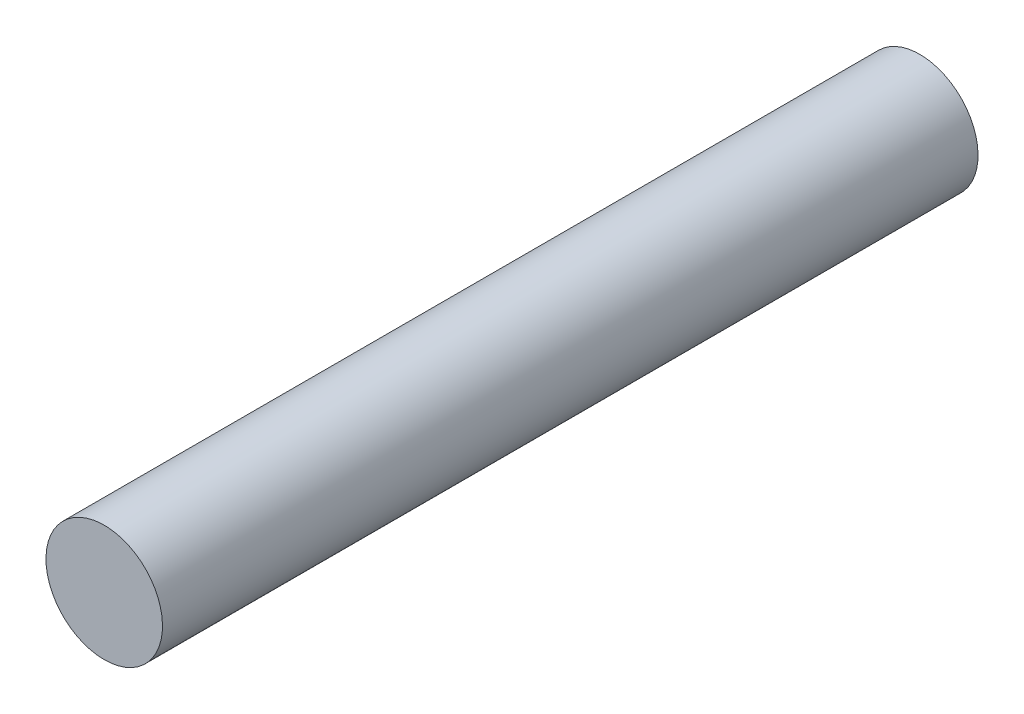
ISO-10303-21;
HEADER;
FILE_DESCRIPTION(('STEP AP214'),'2;1');
FILE_NAME('part.step','',(''),(''),'','','');
FILE_SCHEMA(('AUTOMOTIVE_DESIGN { 1 0 10303 214 1 1 1 1 }'));
ENDSEC;
DATA;
#1=APPLICATION_CONTEXT('core data for automotive mechanical design processes');
#2=APPLICATION_PROTOCOL_DEFINITION('international standard','automotive_design',2000,#1);
#3=PRODUCT_CONTEXT('',#1,'mechanical');
#4=PRODUCT('Part','Part','',(#3));
#5=PRODUCT_RELATED_PRODUCT_CATEGORY('part','',(#4));
#6=PRODUCT_DEFINITION_FORMATION('','',#4);
#7=PRODUCT_DEFINITION_CONTEXT('part definition',#1,'design');
#8=PRODUCT_DEFINITION('design','',#6,#7);
#9=PRODUCT_DEFINITION_SHAPE('','',#8);
#10=(LENGTH_UNIT() NAMED_UNIT(*) SI_UNIT(.MILLI.,.METRE.));
#11=(NAMED_UNIT(*) PLANE_ANGLE_UNIT() SI_UNIT($,.RADIAN.));
#12=(NAMED_UNIT(*) SI_UNIT($,.STERADIAN.) SOLID_ANGLE_UNIT());
#13=UNCERTAINTY_MEASURE_WITH_UNIT(LENGTH_MEASURE(1.E-05),#10,'distance_accuracy_value','');
#14=(GEOMETRIC_REPRESENTATION_CONTEXT(3) GLOBAL_UNCERTAINTY_ASSIGNED_CONTEXT((#13)) GLOBAL_UNIT_ASSIGNED_CONTEXT((#10,
#11,#12)) REPRESENTATION_CONTEXT('',''));
#15=CARTESIAN_POINT('',(0.,0.,0.));
#16=DIRECTION('',(0.,0.,1.));
#17=DIRECTION('',(1.,0.,0.));
#18=AXIS2_PLACEMENT_3D('',#15,#16,#17);
#19=CARTESIAN_POINT('',(0.,0.,70.));
#20=DIRECTION('',(0.,0.,-1.));
#21=DIRECTION('',(0.,1.,0.));
#22=AXIS2_PLACEMENT_3D('',#19,#20,#21);
#23=CYLINDRICAL_SURFACE('',#22,5.);
#24=CARTESIAN_POINT('',(0.,0.,70.));
#25=DIRECTION('',(0.,0.,1.));
#26=DIRECTION('',(0.,-1.,0.));
#27=AXIS2_PLACEMENT_3D('',#24,#25,#26);
#28=CIRCLE('',#27,5.);
#29=CARTESIAN_POINT('',(0.,-5.,70.));
#30=VERTEX_POINT('',#29);
#31=EDGE_CURVE('E10',#30,#30,#28,.T.);
#32=ORIENTED_EDGE('',*,*,#31,.F.);
#33=EDGE_LOOP('',(#32));
#34=FACE_BOUND('',#33,.T.);
#35=CARTESIAN_POINT('',(0.,0.,0.));
#36=DIRECTION('',(0.,0.,1.));
#37=DIRECTION('',(0.,-1.,0.));
#38=AXIS2_PLACEMENT_3D('',#35,#36,#37);
#39=CIRCLE('',#38,5.);
#40=CARTESIAN_POINT('',(0.,-5.,0.));
#41=VERTEX_POINT('',#40);
#42=EDGE_CURVE('E22',#41,#41,#39,.T.);
#43=ORIENTED_EDGE('',*,*,#42,.T.);
#44=EDGE_LOOP('',(#43));
#45=FACE_BOUND('',#44,.T.);
#46=ADVANCED_FACE('F15',(#34,#45),#23,.T.);
#47=CARTESIAN_POINT('',(0.,0.,70.));
#48=DIRECTION('',(0.,0.,1.));
#49=DIRECTION('',(0.,-1.,0.));
#50=AXIS2_PLACEMENT_3D('',#47,#48,#49);
#51=PLANE('',#50);
#52=ORIENTED_EDGE('',*,*,#31,.T.);
#53=EDGE_LOOP('',(#52));
#54=FACE_BOUND('',#53,.T.);
#55=ADVANCED_FACE('F55',(#54),#51,.T.);
#56=CARTESIAN_POINT('',(0.,0.,0.));
#57=DIRECTION('',(0.,0.,1.));
#58=DIRECTION('',(0.,-1.,0.));
#59=AXIS2_PLACEMENT_3D('',#56,#57,#58);
#60=PLANE('',#59);
#61=CARTESIAN_POINT('',(0.,0.,0.));
#62=DIRECTION('',(0.,0.,-1.));
#63=DIRECTION('',(0.,1.,0.));
#64=AXIS2_PLACEMENT_3D('',#61,#62,#63);
#65=CIRCLE('',#64,0.750000000000026);
#66=CARTESIAN_POINT('',(0.,0.750000000000026,0.));
#67=VERTEX_POINT('',#66);
#68=EDGE_CURVE('E29',#67,#67,#65,.T.);
#69=ORIENTED_EDGE('',*,*,#68,.F.);
#70=EDGE_LOOP('',(#69));
#71=FACE_BOUND('',#70,.T.);
#72=ORIENTED_EDGE('',*,*,#42,.F.);
#73=EDGE_LOOP('',(#72));
#74=FACE_BOUND('',#73,.T.);
#75=ADVANCED_FACE('F49',(#71,#74),#60,.F.);
#76=CARTESIAN_POINT('',(0.,0.,5.));
#77=DIRECTION('',(0.,0.,-1.));
#78=DIRECTION('',(0.,1.,0.));
#79=AXIS2_PLACEMENT_3D('',#76,#77,#78);
#80=CYLINDRICAL_SURFACE('',#79,0.750000000000026);
#81=CARTESIAN_POINT('',(0.,0.,5.));
#82=DIRECTION('',(0.,0.,-1.));
#83=DIRECTION('',(0.,1.,0.));
#84=AXIS2_PLACEMENT_3D('',#81,#82,#83);
#85=CIRCLE('',#84,0.750000000000026);
#86=CARTESIAN_POINT('',(0.,0.750000000000026,5.));
#87=VERTEX_POINT('',#86);
#88=EDGE_CURVE('E35',#87,#87,#85,.T.);
#89=ORIENTED_EDGE('',*,*,#88,.F.);
#90=EDGE_LOOP('',(#89));
#91=FACE_BOUND('',#90,.T.);
#92=ORIENTED_EDGE('',*,*,#68,.T.);
#93=EDGE_LOOP('',(#92));
#94=FACE_BOUND('',#93,.T.);
#95=ADVANCED_FACE('F46',(#91,#94),#80,.F.);
#96=CARTESIAN_POINT('',(0.,0.,5.));
#97=DIRECTION('',(0.,0.,-1.));
#98=DIRECTION('',(0.,1.,0.));
#99=AXIS2_PLACEMENT_3D('',#96,#97,#98);
#100=PLANE('',#99);
#101=ORIENTED_EDGE('',*,*,#88,.T.);
#102=EDGE_LOOP('',(#101));
#103=FACE_BOUND('',#102,.T.);
#104=ADVANCED_FACE('F44',(#103),#100,.T.);
#105=CLOSED_SHELL('',(#46,#55,#75,#95,#104));
#106=MANIFOLD_SOLID_BREP('B1',#105);
#107=ADVANCED_BREP_SHAPE_REPRESENTATION('',(#18,#106),#14);
#108=SHAPE_DEFINITION_REPRESENTATION(#9,#107);
ENDSEC;
END-ISO-10303-21;
